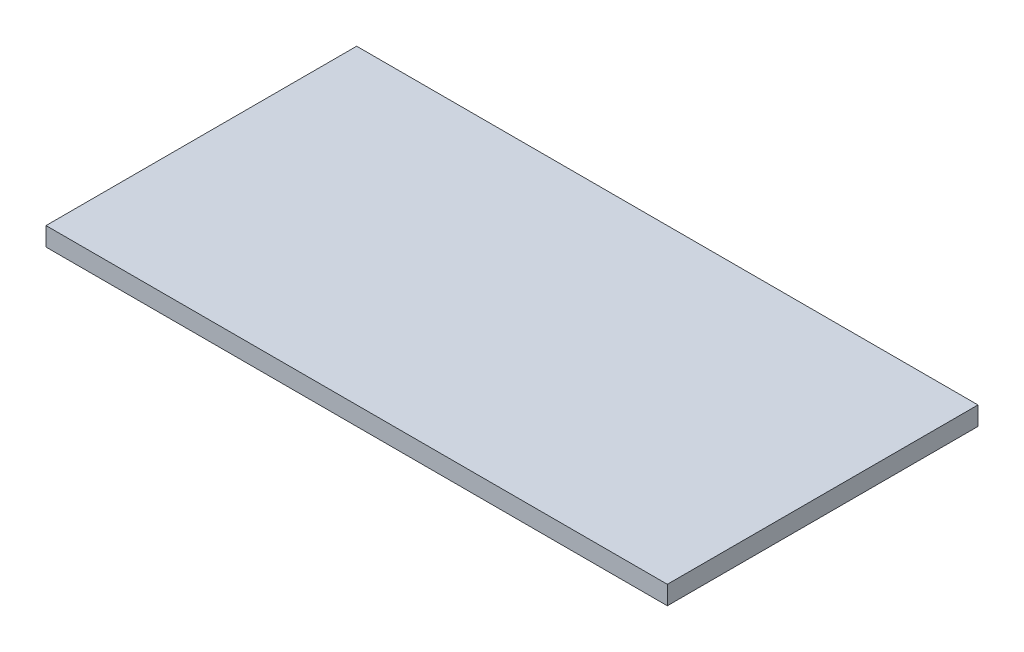
ISO-10303-21;
HEADER;
FILE_DESCRIPTION(('STEP AP214'),'2;1');
FILE_NAME('part.step','',(''),(''),'','','');
FILE_SCHEMA(('AUTOMOTIVE_DESIGN { 1 0 10303 214 1 1 1 1 }'));
ENDSEC;
DATA;
#1=APPLICATION_CONTEXT('core data for automotive mechanical design processes');
#2=APPLICATION_PROTOCOL_DEFINITION('international standard','automotive_design',2000,#1);
#3=PRODUCT_CONTEXT('',#1,'mechanical');
#4=PRODUCT('Part','Part','',(#3));
#5=PRODUCT_RELATED_PRODUCT_CATEGORY('part','',(#4));
#6=PRODUCT_DEFINITION_FORMATION('','',#4);
#7=PRODUCT_DEFINITION_CONTEXT('part definition',#1,'design');
#8=PRODUCT_DEFINITION('design','',#6,#7);
#9=PRODUCT_DEFINITION_SHAPE('','',#8);
#10=(LENGTH_UNIT() NAMED_UNIT(*) SI_UNIT(.MILLI.,.METRE.));
#11=(NAMED_UNIT(*) PLANE_ANGLE_UNIT() SI_UNIT($,.RADIAN.));
#12=(NAMED_UNIT(*) SI_UNIT($,.STERADIAN.) SOLID_ANGLE_UNIT());
#13=UNCERTAINTY_MEASURE_WITH_UNIT(LENGTH_MEASURE(1.E-05),#10,'distance_accuracy_value','');
#14=(GEOMETRIC_REPRESENTATION_CONTEXT(3) GLOBAL_UNCERTAINTY_ASSIGNED_CONTEXT((#13)) GLOBAL_UNIT_ASSIGNED_CONTEXT((#10,
#11,#12)) REPRESENTATION_CONTEXT('',''));
#15=CARTESIAN_POINT('',(0.,0.,0.));
#16=DIRECTION('',(0.,0.,1.));
#17=DIRECTION('',(1.,0.,0.));
#18=AXIS2_PLACEMENT_3D('',#15,#16,#17);
#19=CARTESIAN_POINT('',(0.,18.,0.));
#20=DIRECTION('',(1.,0.,0.));
#21=DIRECTION('',(0.,0.,-1.));
#22=AXIS2_PLACEMENT_3D('',#19,#20,#21);
#23=PLANE('',#22);
#24=DIRECTION('',(0.,0.,1.));
#25=VECTOR('',#24,1.);
#26=CARTESIAN_POINT('',(0.,0.,0.));
#27=LINE('',#26,#25);
#28=CARTESIAN_POINT('',(0.,0.,-300.));
#29=VERTEX_POINT('',#28);
#30=CARTESIAN_POINT('',(0.,0.,0.));
#31=VERTEX_POINT('',#30);
#32=EDGE_CURVE('E97',#29,#31,#27,.T.);
#33=ORIENTED_EDGE('',*,*,#32,.T.);
#34=DIRECTION('',(0.,-1.,0.));
#35=VECTOR('',#34,1.);
#36=CARTESIAN_POINT('',(0.,18.,0.));
#37=LINE('',#36,#35);
#38=CARTESIAN_POINT('',(0.,18.,0.));
#39=VERTEX_POINT('',#38);
#40=EDGE_CURVE('E11',#39,#31,#37,.T.);
#41=ORIENTED_EDGE('',*,*,#40,.F.);
#42=DIRECTION('',(0.,0.,1.));
#43=VECTOR('',#42,1.);
#44=CARTESIAN_POINT('',(0.,18.,0.));
#45=LINE('',#44,#43);
#46=CARTESIAN_POINT('',(0.,18.,-300.));
#47=VERTEX_POINT('',#46);
#48=EDGE_CURVE('E85',#47,#39,#45,.T.);
#49=ORIENTED_EDGE('',*,*,#48,.F.);
#50=DIRECTION('',(0.,-1.,0.));
#51=VECTOR('',#50,1.);
#52=CARTESIAN_POINT('',(0.,18.,-300.));
#53=LINE('',#52,#51);
#54=EDGE_CURVE('E93',#47,#29,#53,.T.);
#55=ORIENTED_EDGE('',*,*,#54,.T.);
#56=EDGE_LOOP('',(#33,#41,#49,#55));
#57=FACE_BOUND('',#56,.T.);
#58=ADVANCED_FACE('F34',(#57),#23,.F.);
#59=CARTESIAN_POINT('',(0.,18.,0.));
#60=DIRECTION('',(0.,0.,-1.));
#61=DIRECTION('',(-1.,0.,0.));
#62=AXIS2_PLACEMENT_3D('',#59,#60,#61);
#63=PLANE('',#62);
#64=DIRECTION('',(1.,0.,0.));
#65=VECTOR('',#64,1.);
#66=CARTESIAN_POINT('',(0.,0.,0.));
#67=LINE('',#66,#65);
#68=CARTESIAN_POINT('',(600.,0.,0.));
#69=VERTEX_POINT('',#68);
#70=EDGE_CURVE('E89',#31,#69,#67,.T.);
#71=ORIENTED_EDGE('',*,*,#70,.T.);
#72=DIRECTION('',(0.,-1.,0.));
#73=VECTOR('',#72,1.);
#74=CARTESIAN_POINT('',(600.,18.,0.));
#75=LINE('',#74,#73);
#76=CARTESIAN_POINT('',(600.,18.,0.));
#77=VERTEX_POINT('',#76);
#78=EDGE_CURVE('E42',#77,#69,#75,.T.);
#79=ORIENTED_EDGE('',*,*,#78,.F.);
#80=DIRECTION('',(1.,0.,0.));
#81=VECTOR('',#80,1.);
#82=CARTESIAN_POINT('',(0.,18.,0.));
#83=LINE('',#82,#81);
#84=EDGE_CURVE('E80',#39,#77,#83,.T.);
#85=ORIENTED_EDGE('',*,*,#84,.F.);
#86=ORIENTED_EDGE('',*,*,#40,.T.);
#87=EDGE_LOOP('',(#71,#79,#85,#86));
#88=FACE_BOUND('',#87,.T.);
#89=ADVANCED_FACE('F88',(#88),#63,.F.);
#90=CARTESIAN_POINT('',(600.,18.,0.));
#91=DIRECTION('',(-1.,0.,0.));
#92=DIRECTION('',(0.,0.,1.));
#93=AXIS2_PLACEMENT_3D('',#90,#91,#92);
#94=PLANE('',#93);
#95=DIRECTION('',(0.,0.,-1.));
#96=VECTOR('',#95,1.);
#97=CARTESIAN_POINT('',(600.,0.,0.));
#98=LINE('',#97,#96);
#99=CARTESIAN_POINT('',(600.,0.,-300.));
#100=VERTEX_POINT('',#99);
#101=EDGE_CURVE('E67',#69,#100,#98,.T.);
#102=ORIENTED_EDGE('',*,*,#101,.T.);
#103=DIRECTION('',(0.,-1.,0.));
#104=VECTOR('',#103,1.);
#105=CARTESIAN_POINT('',(600.,18.,-300.));
#106=LINE('',#105,#104);
#107=CARTESIAN_POINT('',(600.,18.,-300.));
#108=VERTEX_POINT('',#107);
#109=EDGE_CURVE('E90',#108,#100,#106,.T.);
#110=ORIENTED_EDGE('',*,*,#109,.F.);
#111=DIRECTION('',(0.,0.,-1.));
#112=VECTOR('',#111,1.);
#113=CARTESIAN_POINT('',(600.,18.,0.));
#114=LINE('',#113,#112);
#115=EDGE_CURVE('E83',#77,#108,#114,.T.);
#116=ORIENTED_EDGE('',*,*,#115,.F.);
#117=ORIENTED_EDGE('',*,*,#78,.T.);
#118=EDGE_LOOP('',(#102,#110,#116,#117));
#119=FACE_BOUND('',#118,.T.);
#120=ADVANCED_FACE('F91',(#119),#94,.F.);
#121=CARTESIAN_POINT('',(0.,18.,-300.));
#122=DIRECTION('',(0.,0.,1.));
#123=DIRECTION('',(1.,0.,0.));
#124=AXIS2_PLACEMENT_3D('',#121,#122,#123);
#125=PLANE('',#124);
#126=DIRECTION('',(-1.,0.,0.));
#127=VECTOR('',#126,1.);
#128=CARTESIAN_POINT('',(0.,0.,-300.));
#129=LINE('',#128,#127);
#130=EDGE_CURVE('E73',#100,#29,#129,.T.);
#131=ORIENTED_EDGE('',*,*,#130,.T.);
#132=ORIENTED_EDGE('',*,*,#54,.F.);
#133=DIRECTION('',(-1.,0.,0.));
#134=VECTOR('',#133,1.);
#135=CARTESIAN_POINT('',(0.,18.,-300.));
#136=LINE('',#135,#134);
#137=EDGE_CURVE('E50',#108,#47,#136,.T.);
#138=ORIENTED_EDGE('',*,*,#137,.F.);
#139=ORIENTED_EDGE('',*,*,#109,.T.);
#140=EDGE_LOOP('',(#131,#132,#138,#139));
#141=FACE_BOUND('',#140,.T.);
#142=ADVANCED_FACE('F104',(#141),#125,.F.);
#143=CARTESIAN_POINT('',(0.,18.,0.));
#144=DIRECTION('',(0.,-1.,0.));
#145=DIRECTION('',(0.,0.,-1.));
#146=AXIS2_PLACEMENT_3D('',#143,#144,#145);
#147=PLANE('',#146);
#148=ORIENTED_EDGE('',*,*,#48,.T.);
#149=ORIENTED_EDGE('',*,*,#84,.T.);
#150=ORIENTED_EDGE('',*,*,#115,.T.);
#151=ORIENTED_EDGE('',*,*,#137,.T.);
#152=EDGE_LOOP('',(#148,#149,#150,#151));
#153=FACE_BOUND('',#152,.T.);
#154=ADVANCED_FACE('F81',(#153),#147,.F.);
#155=CARTESIAN_POINT('',(0.,0.,0.));
#156=DIRECTION('',(0.,-1.,0.));
#157=DIRECTION('',(0.,0.,-1.));
#158=AXIS2_PLACEMENT_3D('',#155,#156,#157);
#159=PLANE('',#158);
#160=ORIENTED_EDGE('',*,*,#32,.F.);
#161=ORIENTED_EDGE('',*,*,#130,.F.);
#162=ORIENTED_EDGE('',*,*,#101,.F.);
#163=ORIENTED_EDGE('',*,*,#70,.F.);
#164=EDGE_LOOP('',(#160,#161,#162,#163));
#165=FACE_BOUND('',#164,.T.);
#166=ADVANCED_FACE('F107',(#165),#159,.T.);
#167=CLOSED_SHELL('',(#58,#89,#120,#142,#154,#166));
#168=MANIFOLD_SOLID_BREP('B2',#167);
#169=ADVANCED_BREP_SHAPE_REPRESENTATION('',(#18,#168),#14);
#170=SHAPE_DEFINITION_REPRESENTATION(#9,#169);
ENDSEC;
END-ISO-10303-21;
